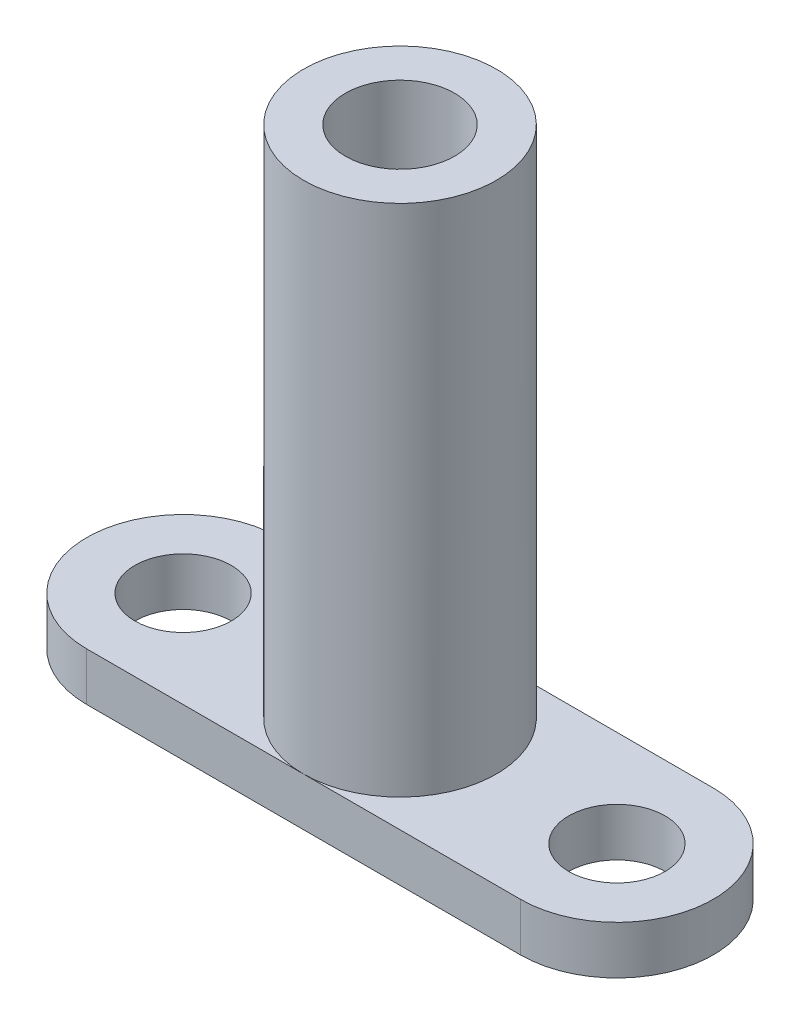
ISO-10303-21;
HEADER;
FILE_DESCRIPTION(('STEP AP214'),'2;1');
FILE_NAME('part.step','',(''),(''),'','','');
FILE_SCHEMA(('AUTOMOTIVE_DESIGN { 1 0 10303 214 1 1 1 1 }'));
ENDSEC;
DATA;
#1=APPLICATION_CONTEXT('core data for automotive mechanical design processes');
#2=APPLICATION_PROTOCOL_DEFINITION('international standard','automotive_design',2000,#1);
#3=PRODUCT_CONTEXT('',#1,'mechanical');
#4=PRODUCT('Part','Part','',(#3));
#5=PRODUCT_RELATED_PRODUCT_CATEGORY('part','',(#4));
#6=PRODUCT_DEFINITION_FORMATION('','',#4);
#7=PRODUCT_DEFINITION_CONTEXT('part definition',#1,'design');
#8=PRODUCT_DEFINITION('design','',#6,#7);
#9=PRODUCT_DEFINITION_SHAPE('','',#8);
#10=(LENGTH_UNIT() NAMED_UNIT(*) SI_UNIT(.MILLI.,.METRE.));
#11=(NAMED_UNIT(*) PLANE_ANGLE_UNIT() SI_UNIT($,.RADIAN.));
#12=(NAMED_UNIT(*) SI_UNIT($,.STERADIAN.) SOLID_ANGLE_UNIT());
#13=UNCERTAINTY_MEASURE_WITH_UNIT(LENGTH_MEASURE(1.E-05),#10,'distance_accuracy_value','');
#14=(GEOMETRIC_REPRESENTATION_CONTEXT(3) GLOBAL_UNCERTAINTY_ASSIGNED_CONTEXT((#13)) GLOBAL_UNIT_ASSIGNED_CONTEXT((#10,
#11,#12)) REPRESENTATION_CONTEXT('',''));
#15=CARTESIAN_POINT('',(0.,0.,0.));
#16=DIRECTION('',(0.,0.,1.));
#17=DIRECTION('',(1.,0.,0.));
#18=AXIS2_PLACEMENT_3D('',#15,#16,#17);
#19=CARTESIAN_POINT('',(0.,3.,0.));
#20=DIRECTION('',(0.,1.,0.));
#21=DIRECTION('',(0.,0.,1.));
#22=AXIS2_PLACEMENT_3D('',#19,#20,#21);
#23=PLANE('',#22);
#24=CARTESIAN_POINT('',(13.5,3.,0.));
#25=DIRECTION('',(0.,1.,0.));
#26=DIRECTION('',(0.,0.,1.));
#27=AXIS2_PLACEMENT_3D('',#24,#25,#26);
#28=CIRCLE('',#27,3.);
#29=CARTESIAN_POINT('',(13.5,3.,3.));
#30=VERTEX_POINT('',#29);
#31=EDGE_CURVE('E151',#30,#30,#28,.T.);
#32=ORIENTED_EDGE('',*,*,#31,.F.);
#33=EDGE_LOOP('',(#32));
#34=FACE_BOUND('',#33,.T.);
#35=CARTESIAN_POINT('',(0.,3.,0.));
#36=DIRECTION('',(0.,1.,0.));
#37=DIRECTION('',(0.,0.,1.));
#38=AXIS2_PLACEMENT_3D('',#35,#36,#37);
#39=CIRCLE('',#38,6.);
#40=CARTESIAN_POINT('',(0.,3.,6.));
#41=VERTEX_POINT('',#40);
#42=CARTESIAN_POINT('',(0.,3.,-6.));
#43=VERTEX_POINT('',#42);
#44=EDGE_CURVE('E52',#41,#43,#39,.T.);
#45=ORIENTED_EDGE('',*,*,#44,.F.);
#46=DIRECTION('',(1.,0.,0.));
#47=VECTOR('',#46,1.);
#48=CARTESIAN_POINT('',(0.,3.,6.));
#49=LINE('',#48,#47);
#50=CARTESIAN_POINT('',(13.5,3.,6.));
#51=VERTEX_POINT('',#50);
#52=EDGE_CURVE('E100',#41,#51,#49,.T.);
#53=ORIENTED_EDGE('',*,*,#52,.T.);
#54=CARTESIAN_POINT('',(13.5,3.,0.));
#55=DIRECTION('',(0.,1.,0.));
#56=DIRECTION('',(0.,0.,1.));
#57=AXIS2_PLACEMENT_3D('',#54,#55,#56);
#58=CIRCLE('',#57,6.);
#59=CARTESIAN_POINT('',(13.5,3.,-6.));
#60=VERTEX_POINT('',#59);
#61=EDGE_CURVE('E99',#51,#60,#58,.T.);
#62=ORIENTED_EDGE('',*,*,#61,.T.);
#63=DIRECTION('',(1.,0.,0.));
#64=VECTOR('',#63,1.);
#65=CARTESIAN_POINT('',(0.,3.,-6.));
#66=LINE('',#65,#64);
#67=EDGE_CURVE('E111',#43,#60,#66,.T.);
#68=ORIENTED_EDGE('',*,*,#67,.F.);
#69=EDGE_LOOP('',(#45,#53,#62,#68));
#70=FACE_BOUND('',#69,.T.);
#71=ADVANCED_FACE('F41',(#34,#70),#23,.T.);
#72=CARTESIAN_POINT('',(-13.5,3.,0.));
#73=DIRECTION('',(0.,-1.,0.));
#74=DIRECTION('',(0.,0.,-1.));
#75=AXIS2_PLACEMENT_3D('',#72,#73,#74);
#76=CYLINDRICAL_SURFACE('',#75,6.);
#77=CARTESIAN_POINT('',(-13.5,0.,0.));
#78=DIRECTION('',(0.,1.,0.));
#79=DIRECTION('',(0.,0.,1.));
#80=AXIS2_PLACEMENT_3D('',#77,#78,#79);
#81=CIRCLE('',#80,6.);
#82=CARTESIAN_POINT('',(-13.5,0.,-6.));
#83=VERTEX_POINT('',#82);
#84=CARTESIAN_POINT('',(-13.5,0.,6.));
#85=VERTEX_POINT('',#84);
#86=EDGE_CURVE('E163',#83,#85,#81,.T.);
#87=ORIENTED_EDGE('',*,*,#86,.T.);
#88=DIRECTION('',(0.,-1.,0.));
#89=VECTOR('',#88,1.);
#90=CARTESIAN_POINT('',(-13.5,3.,6.));
#91=LINE('',#90,#89);
#92=CARTESIAN_POINT('',(-13.5,3.,6.));
#93=VERTEX_POINT('',#92);
#94=EDGE_CURVE('E50',#93,#85,#91,.T.);
#95=ORIENTED_EDGE('',*,*,#94,.F.);
#96=CARTESIAN_POINT('',(-13.5,3.,0.));
#97=DIRECTION('',(0.,1.,0.));
#98=DIRECTION('',(0.,0.,1.));
#99=AXIS2_PLACEMENT_3D('',#96,#97,#98);
#100=CIRCLE('',#99,6.);
#101=CARTESIAN_POINT('',(-13.5,3.,-6.));
#102=VERTEX_POINT('',#101);
#103=EDGE_CURVE('E97',#102,#93,#100,.T.);
#104=ORIENTED_EDGE('',*,*,#103,.F.);
#105=DIRECTION('',(0.,-1.,0.));
#106=VECTOR('',#105,1.);
#107=CARTESIAN_POINT('',(-13.5,3.,-6.));
#108=LINE('',#107,#106);
#109=EDGE_CURVE('E66',#102,#83,#108,.T.);
#110=ORIENTED_EDGE('',*,*,#109,.T.);
#111=EDGE_LOOP('',(#87,#95,#104,#110));
#112=FACE_BOUND('',#111,.T.);
#113=ADVANCED_FACE('F43',(#112),#76,.T.);
#114=CARTESIAN_POINT('',(0.,3.,6.));
#115=DIRECTION('',(0.,0.,-1.));
#116=DIRECTION('',(-1.,0.,0.));
#117=AXIS2_PLACEMENT_3D('',#114,#115,#116);
#118=PLANE('',#117);
#119=DIRECTION('',(1.,0.,0.));
#120=VECTOR('',#119,1.);
#121=CARTESIAN_POINT('',(0.,0.,6.));
#122=LINE('',#121,#120);
#123=CARTESIAN_POINT('',(13.5,0.,6.));
#124=VERTEX_POINT('',#123);
#125=EDGE_CURVE('E171',#85,#124,#122,.T.);
#126=ORIENTED_EDGE('',*,*,#125,.T.);
#127=DIRECTION('',(0.,-1.,0.));
#128=VECTOR('',#127,1.);
#129=CARTESIAN_POINT('',(13.5,3.,6.));
#130=LINE('',#129,#128);
#131=EDGE_CURVE('E106',#51,#124,#130,.T.);
#132=ORIENTED_EDGE('',*,*,#131,.F.);
#133=ORIENTED_EDGE('',*,*,#52,.F.);
#134=EDGE_CURVE('E92',#93,#41,#49,.T.);
#135=ORIENTED_EDGE('',*,*,#134,.F.);
#136=ORIENTED_EDGE('',*,*,#94,.T.);
#137=EDGE_LOOP('',(#126,#132,#133,#135,#136));
#138=FACE_BOUND('',#137,.T.);
#139=ADVANCED_FACE('F104',(#138),#118,.F.);
#140=CARTESIAN_POINT('',(13.5,3.,0.));
#141=DIRECTION('',(0.,-1.,0.));
#142=DIRECTION('',(0.,0.,-1.));
#143=AXIS2_PLACEMENT_3D('',#140,#141,#142);
#144=CYLINDRICAL_SURFACE('',#143,6.);
#145=CARTESIAN_POINT('',(13.5,0.,0.));
#146=DIRECTION('',(0.,1.,0.));
#147=DIRECTION('',(0.,0.,1.));
#148=AXIS2_PLACEMENT_3D('',#145,#146,#147);
#149=CIRCLE('',#148,6.);
#150=CARTESIAN_POINT('',(13.5,0.,-6.));
#151=VERTEX_POINT('',#150);
#152=EDGE_CURVE('E173',#124,#151,#149,.T.);
#153=ORIENTED_EDGE('',*,*,#152,.T.);
#154=DIRECTION('',(0.,-1.,0.));
#155=VECTOR('',#154,1.);
#156=CARTESIAN_POINT('',(13.5,3.,-6.));
#157=LINE('',#156,#155);
#158=EDGE_CURVE('E179',#60,#151,#157,.T.);
#159=ORIENTED_EDGE('',*,*,#158,.F.);
#160=ORIENTED_EDGE('',*,*,#61,.F.);
#161=ORIENTED_EDGE('',*,*,#131,.T.);
#162=EDGE_LOOP('',(#153,#159,#160,#161));
#163=FACE_BOUND('',#162,.T.);
#164=ADVANCED_FACE('F144',(#163),#144,.T.);
#165=CARTESIAN_POINT('',(0.,3.,-6.));
#166=DIRECTION('',(0.,0.,-1.));
#167=DIRECTION('',(-1.,0.,0.));
#168=AXIS2_PLACEMENT_3D('',#165,#166,#167);
#169=PLANE('',#168);
#170=DIRECTION('',(1.,0.,0.));
#171=VECTOR('',#170,1.);
#172=CARTESIAN_POINT('',(0.,0.,-6.));
#173=LINE('',#172,#171);
#174=EDGE_CURVE('E165',#83,#151,#173,.T.);
#175=ORIENTED_EDGE('',*,*,#174,.F.);
#176=ORIENTED_EDGE('',*,*,#109,.F.);
#177=EDGE_CURVE('E168',#102,#43,#66,.T.);
#178=ORIENTED_EDGE('',*,*,#177,.T.);
#179=ORIENTED_EDGE('',*,*,#67,.T.);
#180=ORIENTED_EDGE('',*,*,#158,.T.);
#181=EDGE_LOOP('',(#175,#176,#178,#179,#180));
#182=FACE_BOUND('',#181,.T.);
#183=ADVANCED_FACE('F139',(#182),#169,.T.);
#184=CARTESIAN_POINT('',(-13.5,3.,0.));
#185=DIRECTION('',(0.,1.,0.));
#186=DIRECTION('',(0.,0.,1.));
#187=AXIS2_PLACEMENT_3D('',#184,#185,#186);
#188=CIRCLE('',#187,3.);
#189=CARTESIAN_POINT('',(-13.5,3.,3.));
#190=VERTEX_POINT('',#189);
#191=EDGE_CURVE('E148',#190,#190,#188,.T.);
#192=ORIENTED_EDGE('',*,*,#191,.F.);
#193=EDGE_LOOP('',(#192));
#194=FACE_BOUND('',#193,.T.);
#195=EDGE_CURVE('E11',#43,#41,#39,.T.);
#196=ORIENTED_EDGE('',*,*,#195,.F.);
#197=ORIENTED_EDGE('',*,*,#177,.F.);
#198=ORIENTED_EDGE('',*,*,#103,.T.);
#199=ORIENTED_EDGE('',*,*,#134,.T.);
#200=EDGE_LOOP('',(#196,#197,#198,#199));
#201=FACE_BOUND('',#200,.T.);
#202=ADVANCED_FACE('F96',(#194,#201),#23,.T.);
#203=CARTESIAN_POINT('',(0.,0.,0.));
#204=DIRECTION('',(0.,1.,0.));
#205=DIRECTION('',(0.,0.,1.));
#206=AXIS2_PLACEMENT_3D('',#203,#204,#205);
#207=PLANE('',#206);
#208=CARTESIAN_POINT('',(-13.5,0.,0.));
#209=DIRECTION('',(0.,1.,0.));
#210=DIRECTION('',(0.,0.,1.));
#211=AXIS2_PLACEMENT_3D('',#208,#209,#210);
#212=CIRCLE('',#211,3.);
#213=CARTESIAN_POINT('',(-13.5,0.,3.));
#214=VERTEX_POINT('',#213);
#215=EDGE_CURVE('E45',#214,#214,#212,.T.);
#216=ORIENTED_EDGE('',*,*,#215,.T.);
#217=EDGE_LOOP('',(#216));
#218=FACE_BOUND('',#217,.T.);
#219=CARTESIAN_POINT('',(13.5,0.,0.));
#220=DIRECTION('',(0.,1.,0.));
#221=DIRECTION('',(0.,0.,1.));
#222=AXIS2_PLACEMENT_3D('',#219,#220,#221);
#223=CIRCLE('',#222,3.);
#224=CARTESIAN_POINT('',(13.5,0.,3.));
#225=VERTEX_POINT('',#224);
#226=EDGE_CURVE('E150',#225,#225,#223,.T.);
#227=ORIENTED_EDGE('',*,*,#226,.T.);
#228=EDGE_LOOP('',(#227));
#229=FACE_BOUND('',#228,.T.);
#230=CARTESIAN_POINT('',(0.,0.,0.));
#231=DIRECTION('',(0.,1.,0.));
#232=DIRECTION('',(0.,0.,1.));
#233=AXIS2_PLACEMENT_3D('',#230,#231,#232);
#234=CIRCLE('',#233,3.39999999999999);
#235=CARTESIAN_POINT('',(0.,0.,3.39999999999999));
#236=VERTEX_POINT('',#235);
#237=EDGE_CURVE('E114',#236,#236,#234,.T.);
#238=ORIENTED_EDGE('',*,*,#237,.T.);
#239=EDGE_LOOP('',(#238));
#240=FACE_BOUND('',#239,.T.);
#241=ORIENTED_EDGE('',*,*,#86,.F.);
#242=ORIENTED_EDGE('',*,*,#174,.T.);
#243=ORIENTED_EDGE('',*,*,#152,.F.);
#244=ORIENTED_EDGE('',*,*,#125,.F.);
#245=EDGE_LOOP('',(#241,#242,#243,#244));
#246=FACE_BOUND('',#245,.T.);
#247=ADVANCED_FACE('F118',(#218,#229,#240,#246),#207,.F.);
#248=CARTESIAN_POINT('',(0.,35.,0.));
#249=DIRECTION('',(0.,-1.,0.));
#250=DIRECTION('',(0.,0.,-1.));
#251=AXIS2_PLACEMENT_3D('',#248,#249,#250);
#252=CYLINDRICAL_SURFACE('',#251,6.);
#253=CARTESIAN_POINT('',(0.,35.,0.));
#254=DIRECTION('',(0.,1.,0.));
#255=DIRECTION('',(0.,0.,1.));
#256=AXIS2_PLACEMENT_3D('',#253,#254,#255);
#257=CIRCLE('',#256,6.);
#258=CARTESIAN_POINT('',(0.,35.,6.));
#259=VERTEX_POINT('',#258);
#260=EDGE_CURVE('E113',#259,#259,#257,.T.);
#261=ORIENTED_EDGE('',*,*,#260,.F.);
#262=EDGE_LOOP('',(#261));
#263=FACE_BOUND('',#262,.T.);
#264=ORIENTED_EDGE('',*,*,#44,.T.);
#265=ORIENTED_EDGE('',*,*,#195,.T.);
#266=EDGE_LOOP('',(#264,#265));
#267=FACE_BOUND('',#266,.T.);
#268=ADVANCED_FACE('F115',(#263,#267),#252,.T.);
#269=CARTESIAN_POINT('',(0.,35.,0.));
#270=DIRECTION('',(0.,1.,0.));
#271=DIRECTION('',(0.,0.,1.));
#272=AXIS2_PLACEMENT_3D('',#269,#270,#271);
#273=PLANE('',#272);
#274=CARTESIAN_POINT('',(0.,35.,0.));
#275=DIRECTION('',(0.,1.,0.));
#276=DIRECTION('',(0.,0.,1.));
#277=AXIS2_PLACEMENT_3D('',#274,#275,#276);
#278=CIRCLE('',#277,3.4);
#279=CARTESIAN_POINT('',(0.,35.,3.4));
#280=VERTEX_POINT('',#279);
#281=EDGE_CURVE('E157',#280,#280,#278,.T.);
#282=ORIENTED_EDGE('',*,*,#281,.F.);
#283=EDGE_LOOP('',(#282));
#284=FACE_BOUND('',#283,.T.);
#285=ORIENTED_EDGE('',*,*,#260,.T.);
#286=EDGE_LOOP('',(#285));
#287=FACE_BOUND('',#286,.T.);
#288=ADVANCED_FACE('F117',(#284,#287),#273,.T.);
#289=CARTESIAN_POINT('',(0.,35.,0.));
#290=DIRECTION('',(0.,1.,0.));
#291=DIRECTION('',(0.,0.,1.));
#292=AXIS2_PLACEMENT_3D('',#289,#290,#291);
#293=CYLINDRICAL_SURFACE('',#292,3.39999999999999);
#294=ORIENTED_EDGE('',*,*,#237,.F.);
#295=EDGE_LOOP('',(#294));
#296=FACE_BOUND('',#295,.T.);
#297=ORIENTED_EDGE('',*,*,#281,.T.);
#298=EDGE_LOOP('',(#297));
#299=FACE_BOUND('',#298,.T.);
#300=ADVANCED_FACE('F125',(#296,#299),#293,.F.);
#301=CARTESIAN_POINT('',(13.5,-7.,0.));
#302=DIRECTION('',(0.,1.,0.));
#303=DIRECTION('',(0.,0.,1.));
#304=AXIS2_PLACEMENT_3D('',#301,#302,#303);
#305=CYLINDRICAL_SURFACE('',#304,3.);
#306=ORIENTED_EDGE('',*,*,#31,.T.);
#307=EDGE_LOOP('',(#306));
#308=FACE_BOUND('',#307,.T.);
#309=ORIENTED_EDGE('',*,*,#226,.F.);
#310=EDGE_LOOP('',(#309));
#311=FACE_BOUND('',#310,.T.);
#312=ADVANCED_FACE('F260',(#308,#311),#305,.F.);
#313=CARTESIAN_POINT('',(-13.5,-7.,0.));
#314=DIRECTION('',(0.,1.,0.));
#315=DIRECTION('',(0.,0.,1.));
#316=AXIS2_PLACEMENT_3D('',#313,#314,#315);
#317=CYLINDRICAL_SURFACE('',#316,3.);
#318=ORIENTED_EDGE('',*,*,#191,.T.);
#319=EDGE_LOOP('',(#318));
#320=FACE_BOUND('',#319,.T.);
#321=ORIENTED_EDGE('',*,*,#215,.F.);
#322=EDGE_LOOP('',(#321));
#323=FACE_BOUND('',#322,.T.);
#324=ADVANCED_FACE('F269',(#320,#323),#317,.F.);
#325=CLOSED_SHELL('',(#71,#113,#139,#164,#183,#202,#247,#268,#288,#300,#312,#324));
#326=MANIFOLD_SOLID_BREP('B2',#325);
#327=ADVANCED_BREP_SHAPE_REPRESENTATION('',(#18,#326),#14);
#328=SHAPE_DEFINITION_REPRESENTATION(#9,#327);
ENDSEC;
END-ISO-10303-21;
